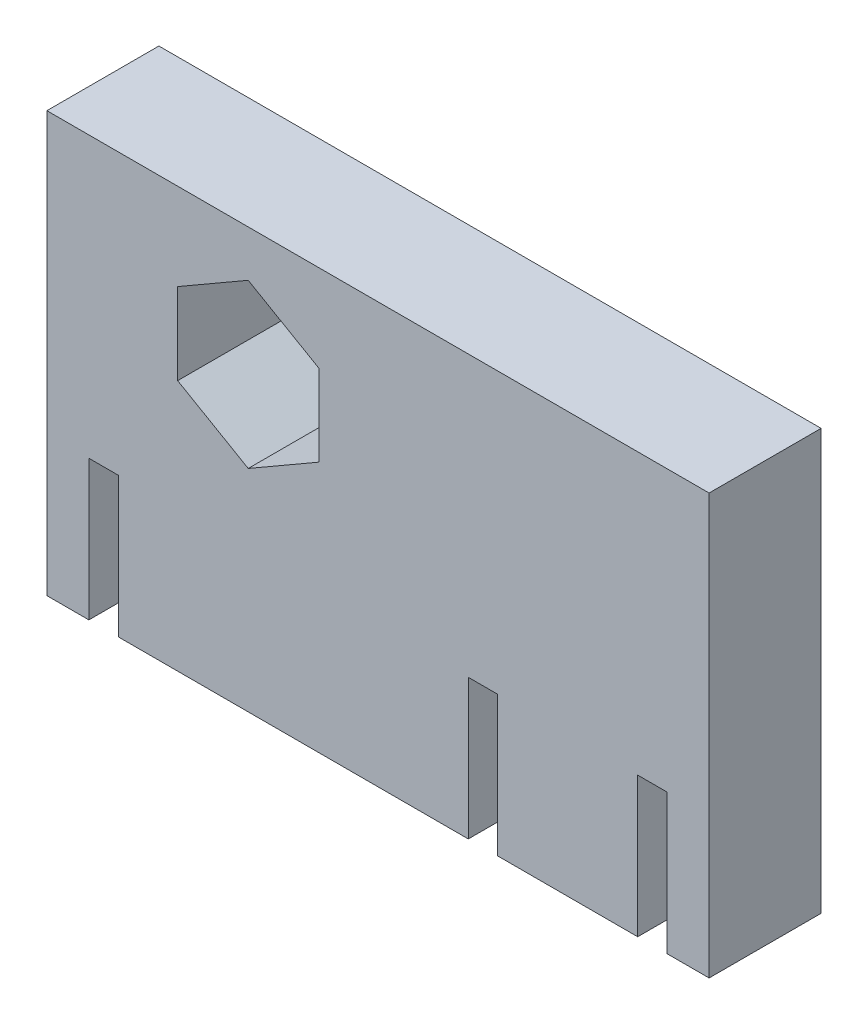
ISO-10303-21;
HEADER;
FILE_DESCRIPTION(('STEP AP214'),'2;1');
FILE_NAME('part.step','',(''),(''),'','','');
FILE_SCHEMA(('AUTOMOTIVE_DESIGN { 1 0 10303 214 1 1 1 1 }'));
ENDSEC;
DATA;
#1=APPLICATION_CONTEXT('core data for automotive mechanical design processes');
#2=APPLICATION_PROTOCOL_DEFINITION('international standard','automotive_design',2000,#1);
#3=PRODUCT_CONTEXT('',#1,'mechanical');
#4=PRODUCT('Part','Part','',(#3));
#5=PRODUCT_RELATED_PRODUCT_CATEGORY('part','',(#4));
#6=PRODUCT_DEFINITION_FORMATION('','',#4);
#7=PRODUCT_DEFINITION_CONTEXT('part definition',#1,'design');
#8=PRODUCT_DEFINITION('design','',#6,#7);
#9=PRODUCT_DEFINITION_SHAPE('','',#8);
#10=(LENGTH_UNIT() NAMED_UNIT(*) SI_UNIT(.MILLI.,.METRE.));
#11=(NAMED_UNIT(*) PLANE_ANGLE_UNIT() SI_UNIT($,.RADIAN.));
#12=(NAMED_UNIT(*) SI_UNIT($,.STERADIAN.) SOLID_ANGLE_UNIT());
#13=UNCERTAINTY_MEASURE_WITH_UNIT(LENGTH_MEASURE(1.E-05),#10,'distance_accuracy_value','');
#14=(GEOMETRIC_REPRESENTATION_CONTEXT(3) GLOBAL_UNCERTAINTY_ASSIGNED_CONTEXT((#13)) GLOBAL_UNIT_ASSIGNED_CONTEXT((#10,
#11,#12)) REPRESENTATION_CONTEXT('',''));
#15=CARTESIAN_POINT('',(0.,0.,0.));
#16=DIRECTION('',(0.,0.,1.));
#17=DIRECTION('',(1.,0.,0.));
#18=AXIS2_PLACEMENT_3D('',#15,#16,#17);
#19=CARTESIAN_POINT('',(0.,0.,8.));
#20=DIRECTION('',(0.,0.,-1.));
#21=DIRECTION('',(-1.,0.,0.));
#22=AXIS2_PLACEMENT_3D('',#19,#20,#21);
#23=PLANE('',#22);
#24=DIRECTION('',(0.,1.,0.));
#25=VECTOR('',#24,1.);
#26=CARTESIAN_POINT('',(23.65,-15.,8.));
#27=LINE('',#26,#25);
#28=CARTESIAN_POINT('',(23.65,-15.,8.));
#29=VERTEX_POINT('',#28);
#30=CARTESIAN_POINT('',(23.65,15.,8.));
#31=VERTEX_POINT('',#30);
#32=EDGE_CURVE('E264',#29,#31,#27,.T.);
#33=ORIENTED_EDGE('',*,*,#32,.T.);
#34=DIRECTION('',(-1.,0.,0.));
#35=VECTOR('',#34,1.);
#36=CARTESIAN_POINT('',(-23.65,15.,8.));
#37=LINE('',#36,#35);
#38=CARTESIAN_POINT('',(-23.65,15.,8.));
#39=VERTEX_POINT('',#38);
#40=EDGE_CURVE('E268',#31,#39,#37,.T.);
#41=ORIENTED_EDGE('',*,*,#40,.T.);
#42=DIRECTION('',(0.,-1.,0.));
#43=VECTOR('',#42,1.);
#44=CARTESIAN_POINT('',(-23.65,-15.,8.));
#45=LINE('',#44,#43);
#46=CARTESIAN_POINT('',(-23.65,-15.,8.));
#47=VERTEX_POINT('',#46);
#48=EDGE_CURVE('E272',#39,#47,#45,.T.);
#49=ORIENTED_EDGE('',*,*,#48,.T.);
#50=DIRECTION('',(1.,0.,0.));
#51=VECTOR('',#50,1.);
#52=CARTESIAN_POINT('',(-23.65,-15.,8.));
#53=LINE('',#52,#51);
#54=CARTESIAN_POINT('',(-20.65,-15.,8.));
#55=VERTEX_POINT('',#54);
#56=EDGE_CURVE('E275',#47,#55,#53,.T.);
#57=ORIENTED_EDGE('',*,*,#56,.T.);
#58=DIRECTION('',(0.,1.,0.));
#59=VECTOR('',#58,1.);
#60=CARTESIAN_POINT('',(-20.65,-15.,8.));
#61=LINE('',#60,#59);
#62=CARTESIAN_POINT('',(-20.65,-5.,8.));
#63=VERTEX_POINT('',#62);
#64=EDGE_CURVE('E278',#55,#63,#61,.T.);
#65=ORIENTED_EDGE('',*,*,#64,.T.);
#66=DIRECTION('',(1.,0.,0.));
#67=VECTOR('',#66,1.);
#68=CARTESIAN_POINT('',(-20.65,-5.,8.));
#69=LINE('',#68,#67);
#70=CARTESIAN_POINT('',(-18.55,-5.,8.));
#71=VERTEX_POINT('',#70);
#72=EDGE_CURVE('E281',#63,#71,#69,.T.);
#73=ORIENTED_EDGE('',*,*,#72,.T.);
#74=DIRECTION('',(0.,-1.,0.));
#75=VECTOR('',#74,1.);
#76=CARTESIAN_POINT('',(-18.55,-5.,8.));
#77=LINE('',#76,#75);
#78=CARTESIAN_POINT('',(-18.55,-15.,8.));
#79=VERTEX_POINT('',#78);
#80=EDGE_CURVE('E284',#71,#79,#77,.T.);
#81=ORIENTED_EDGE('',*,*,#80,.T.);
#82=DIRECTION('',(1.,0.,0.));
#83=VECTOR('',#82,1.);
#84=CARTESIAN_POINT('',(-18.55,-15.,8.));
#85=LINE('',#84,#83);
#86=CARTESIAN_POINT('',(6.45,-15.,8.));
#87=VERTEX_POINT('',#86);
#88=EDGE_CURVE('E287',#79,#87,#85,.T.);
#89=ORIENTED_EDGE('',*,*,#88,.T.);
#90=DIRECTION('',(0.,1.,0.));
#91=VECTOR('',#90,1.);
#92=CARTESIAN_POINT('',(6.45,-15.,8.));
#93=LINE('',#92,#91);
#94=CARTESIAN_POINT('',(6.45,-5.,8.));
#95=VERTEX_POINT('',#94);
#96=EDGE_CURVE('E290',#87,#95,#93,.T.);
#97=ORIENTED_EDGE('',*,*,#96,.T.);
#98=DIRECTION('',(1.,0.,0.));
#99=VECTOR('',#98,1.);
#100=CARTESIAN_POINT('',(6.45,-5.,8.));
#101=LINE('',#100,#99);
#102=CARTESIAN_POINT('',(8.55000000000001,-5.,8.));
#103=VERTEX_POINT('',#102);
#104=EDGE_CURVE('E293',#95,#103,#101,.T.);
#105=ORIENTED_EDGE('',*,*,#104,.T.);
#106=DIRECTION('',(0.,-1.,0.));
#107=VECTOR('',#106,1.);
#108=CARTESIAN_POINT('',(8.55000000000001,-5.,8.));
#109=LINE('',#108,#107);
#110=CARTESIAN_POINT('',(8.55000000000001,-15.,8.));
#111=VERTEX_POINT('',#110);
#112=EDGE_CURVE('E296',#103,#111,#109,.T.);
#113=ORIENTED_EDGE('',*,*,#112,.T.);
#114=DIRECTION('',(1.,0.,0.));
#115=VECTOR('',#114,1.);
#116=CARTESIAN_POINT('',(8.55000000000001,-15.,8.));
#117=LINE('',#116,#115);
#118=CARTESIAN_POINT('',(18.55,-15.,8.));
#119=VERTEX_POINT('',#118);
#120=EDGE_CURVE('E299',#111,#119,#117,.T.);
#121=ORIENTED_EDGE('',*,*,#120,.T.);
#122=DIRECTION('',(0.,1.,0.));
#123=VECTOR('',#122,1.);
#124=CARTESIAN_POINT('',(18.55,-15.,8.));
#125=LINE('',#124,#123);
#126=CARTESIAN_POINT('',(18.55,-5.,8.));
#127=VERTEX_POINT('',#126);
#128=EDGE_CURVE('E302',#119,#127,#125,.T.);
#129=ORIENTED_EDGE('',*,*,#128,.T.);
#130=DIRECTION('',(1.,0.,0.));
#131=VECTOR('',#130,1.);
#132=CARTESIAN_POINT('',(18.55,-5.,8.));
#133=LINE('',#132,#131);
#134=CARTESIAN_POINT('',(20.65,-5.,8.));
#135=VERTEX_POINT('',#134);
#136=EDGE_CURVE('E305',#127,#135,#133,.T.);
#137=ORIENTED_EDGE('',*,*,#136,.T.);
#138=DIRECTION('',(0.,-1.,0.));
#139=VECTOR('',#138,1.);
#140=CARTESIAN_POINT('',(20.65,-5.,8.));
#141=LINE('',#140,#139);
#142=CARTESIAN_POINT('',(20.65,-15.,8.));
#143=VERTEX_POINT('',#142);
#144=EDGE_CURVE('E308',#135,#143,#141,.T.);
#145=ORIENTED_EDGE('',*,*,#144,.T.);
#146=DIRECTION('',(1.,0.,0.));
#147=VECTOR('',#146,1.);
#148=CARTESIAN_POINT('',(20.65,-15.,8.));
#149=LINE('',#148,#147);
#150=EDGE_CURVE('E311',#143,#29,#149,.T.);
#151=ORIENTED_EDGE('',*,*,#150,.T.);
#152=EDGE_LOOP('',(#33,#41,#49,#57,#65,#73,#81,#89,#97,#105,#113,#121,#129,#137,#145,#151));
#153=FACE_BOUND('',#152,.T.);
#154=DIRECTION('',(0.,1.,0.));
#155=VECTOR('',#154,1.);
#156=CARTESIAN_POINT('',(-4.22902577193514,2.96902934007185,8.));
#157=LINE('',#156,#155);
#158=CARTESIAN_POINT('',(-4.22902577193514,2.96902934007185,8.));
#159=VERTEX_POINT('',#158);
#160=CARTESIAN_POINT('',(-4.2290257719351,8.78872005350328,8.));
#161=VERTEX_POINT('',#160);
#162=EDGE_CURVE('E195',#159,#161,#157,.T.);
#163=ORIENTED_EDGE('',*,*,#162,.F.);
#164=DIRECTION('',(0.866025403784442,0.499999999999994,0.));
#165=VECTOR('',#164,1.);
#166=CARTESIAN_POINT('',(-9.26902577193516,0.0591839833561725,8.));
#167=LINE('',#166,#165);
#168=CARTESIAN_POINT('',(-9.26902577193516,0.0591839833561734,8.));
#169=VERTEX_POINT('',#168);
#170=EDGE_CURVE('E230',#169,#159,#167,.T.);
#171=ORIENTED_EDGE('',*,*,#170,.F.);
#172=DIRECTION('',(0.866025403784435,-0.500000000000006,0.));
#173=VECTOR('',#172,1.);
#174=CARTESIAN_POINT('',(-14.3090257719351,2.96902934007192,8.));
#175=LINE('',#174,#173);
#176=CARTESIAN_POINT('',(-14.3090257719351,2.96902934007192,8.));
#177=VERTEX_POINT('',#176);
#178=EDGE_CURVE('E227',#177,#169,#175,.T.);
#179=ORIENTED_EDGE('',*,*,#178,.F.);
#180=DIRECTION('',(0.,-1.,0.));
#181=VECTOR('',#180,1.);
#182=CARTESIAN_POINT('',(-14.3090257719351,8.78872005350335,8.));
#183=LINE('',#182,#181);
#184=CARTESIAN_POINT('',(-14.3090257719351,8.78872005350335,8.));
#185=VERTEX_POINT('',#184);
#186=EDGE_CURVE('E222',#185,#177,#183,.T.);
#187=ORIENTED_EDGE('',*,*,#186,.F.);
#188=DIRECTION('',(-0.866025403784442,-0.499999999999994,0.));
#189=VECTOR('',#188,1.);
#190=CARTESIAN_POINT('',(-9.26902577193508,11.698565410219,8.));
#191=LINE('',#190,#189);
#192=CARTESIAN_POINT('',(-9.26902577193508,11.698565410219,8.));
#193=VERTEX_POINT('',#192);
#194=EDGE_CURVE('E218',#193,#185,#191,.T.);
#195=ORIENTED_EDGE('',*,*,#194,.F.);
#196=DIRECTION('',(-0.866025403784435,0.500000000000006,0.));
#197=VECTOR('',#196,1.);
#198=CARTESIAN_POINT('',(-4.2290257719351,8.78872005350328,8.));
#199=LINE('',#198,#197);
#200=EDGE_CURVE('E204',#161,#193,#199,.T.);
#201=ORIENTED_EDGE('',*,*,#200,.F.);
#202=EDGE_LOOP('',(#163,#171,#179,#187,#195,#201));
#203=FACE_BOUND('',#202,.T.);
#204=ADVANCED_FACE('F45',(#153,#203),#23,.F.);
#205=CARTESIAN_POINT('',(0.,0.,0.));
#206=DIRECTION('',(0.,0.,-1.));
#207=DIRECTION('',(-1.,0.,0.));
#208=AXIS2_PLACEMENT_3D('',#205,#206,#207);
#209=PLANE('',#208);
#210=DIRECTION('',(0.,1.,0.));
#211=VECTOR('',#210,1.);
#212=CARTESIAN_POINT('',(23.65,-15.,0.));
#213=LINE('',#212,#211);
#214=CARTESIAN_POINT('',(23.65,-15.,0.));
#215=VERTEX_POINT('',#214);
#216=CARTESIAN_POINT('',(23.65,15.,0.));
#217=VERTEX_POINT('',#216);
#218=EDGE_CURVE('E213',#215,#217,#213,.T.);
#219=ORIENTED_EDGE('',*,*,#218,.F.);
#220=DIRECTION('',(1.,0.,0.));
#221=VECTOR('',#220,1.);
#222=CARTESIAN_POINT('',(20.65,-15.,0.));
#223=LINE('',#222,#221);
#224=CARTESIAN_POINT('',(20.65,-15.,0.));
#225=VERTEX_POINT('',#224);
#226=EDGE_CURVE('E269',#225,#215,#223,.T.);
#227=ORIENTED_EDGE('',*,*,#226,.F.);
#228=DIRECTION('',(0.,-1.,0.));
#229=VECTOR('',#228,1.);
#230=CARTESIAN_POINT('',(20.65,-5.,0.));
#231=LINE('',#230,#229);
#232=CARTESIAN_POINT('',(20.65,-5.,0.));
#233=VERTEX_POINT('',#232);
#234=EDGE_CURVE('E357',#233,#225,#231,.T.);
#235=ORIENTED_EDGE('',*,*,#234,.F.);
#236=DIRECTION('',(1.,0.,0.));
#237=VECTOR('',#236,1.);
#238=CARTESIAN_POINT('',(18.55,-5.,0.));
#239=LINE('',#238,#237);
#240=CARTESIAN_POINT('',(18.55,-5.,0.));
#241=VERTEX_POINT('',#240);
#242=EDGE_CURVE('E354',#241,#233,#239,.T.);
#243=ORIENTED_EDGE('',*,*,#242,.F.);
#244=DIRECTION('',(0.,1.,0.));
#245=VECTOR('',#244,1.);
#246=CARTESIAN_POINT('',(18.55,-15.,0.));
#247=LINE('',#246,#245);
#248=CARTESIAN_POINT('',(18.55,-15.,0.));
#249=VERTEX_POINT('',#248);
#250=EDGE_CURVE('E351',#249,#241,#247,.T.);
#251=ORIENTED_EDGE('',*,*,#250,.F.);
#252=DIRECTION('',(1.,0.,0.));
#253=VECTOR('',#252,1.);
#254=CARTESIAN_POINT('',(8.55000000000001,-15.,0.));
#255=LINE('',#254,#253);
#256=CARTESIAN_POINT('',(8.55000000000001,-15.,0.));
#257=VERTEX_POINT('',#256);
#258=EDGE_CURVE('E348',#257,#249,#255,.T.);
#259=ORIENTED_EDGE('',*,*,#258,.F.);
#260=DIRECTION('',(0.,-1.,0.));
#261=VECTOR('',#260,1.);
#262=CARTESIAN_POINT('',(8.55000000000001,-5.,0.));
#263=LINE('',#262,#261);
#264=CARTESIAN_POINT('',(8.55000000000001,-5.,0.));
#265=VERTEX_POINT('',#264);
#266=EDGE_CURVE('E345',#265,#257,#263,.T.);
#267=ORIENTED_EDGE('',*,*,#266,.F.);
#268=DIRECTION('',(1.,0.,0.));
#269=VECTOR('',#268,1.);
#270=CARTESIAN_POINT('',(6.45,-5.,0.));
#271=LINE('',#270,#269);
#272=CARTESIAN_POINT('',(6.45,-5.,0.));
#273=VERTEX_POINT('',#272);
#274=EDGE_CURVE('E342',#273,#265,#271,.T.);
#275=ORIENTED_EDGE('',*,*,#274,.F.);
#276=DIRECTION('',(0.,1.,0.));
#277=VECTOR('',#276,1.);
#278=CARTESIAN_POINT('',(6.45,-15.,0.));
#279=LINE('',#278,#277);
#280=CARTESIAN_POINT('',(6.45,-15.,0.));
#281=VERTEX_POINT('',#280);
#282=EDGE_CURVE('E339',#281,#273,#279,.T.);
#283=ORIENTED_EDGE('',*,*,#282,.F.);
#284=DIRECTION('',(1.,0.,0.));
#285=VECTOR('',#284,1.);
#286=CARTESIAN_POINT('',(-18.55,-15.,0.));
#287=LINE('',#286,#285);
#288=CARTESIAN_POINT('',(-18.55,-15.,0.));
#289=VERTEX_POINT('',#288);
#290=EDGE_CURVE('E336',#289,#281,#287,.T.);
#291=ORIENTED_EDGE('',*,*,#290,.F.);
#292=DIRECTION('',(0.,-1.,0.));
#293=VECTOR('',#292,1.);
#294=CARTESIAN_POINT('',(-18.55,-5.,0.));
#295=LINE('',#294,#293);
#296=CARTESIAN_POINT('',(-18.55,-5.,0.));
#297=VERTEX_POINT('',#296);
#298=EDGE_CURVE('E333',#297,#289,#295,.T.);
#299=ORIENTED_EDGE('',*,*,#298,.F.);
#300=DIRECTION('',(1.,0.,0.));
#301=VECTOR('',#300,1.);
#302=CARTESIAN_POINT('',(-20.65,-5.,0.));
#303=LINE('',#302,#301);
#304=CARTESIAN_POINT('',(-20.65,-5.,0.));
#305=VERTEX_POINT('',#304);
#306=EDGE_CURVE('E330',#305,#297,#303,.T.);
#307=ORIENTED_EDGE('',*,*,#306,.F.);
#308=DIRECTION('',(0.,1.,0.));
#309=VECTOR('',#308,1.);
#310=CARTESIAN_POINT('',(-20.65,-15.,0.));
#311=LINE('',#310,#309);
#312=CARTESIAN_POINT('',(-20.65,-15.,0.));
#313=VERTEX_POINT('',#312);
#314=EDGE_CURVE('E327',#313,#305,#311,.T.);
#315=ORIENTED_EDGE('',*,*,#314,.F.);
#316=DIRECTION('',(1.,0.,0.));
#317=VECTOR('',#316,1.);
#318=CARTESIAN_POINT('',(-23.65,-15.,0.));
#319=LINE('',#318,#317);
#320=CARTESIAN_POINT('',(-23.65,-15.,0.));
#321=VERTEX_POINT('',#320);
#322=EDGE_CURVE('E324',#321,#313,#319,.T.);
#323=ORIENTED_EDGE('',*,*,#322,.F.);
#324=DIRECTION('',(0.,-1.,0.));
#325=VECTOR('',#324,1.);
#326=CARTESIAN_POINT('',(-23.65,-15.,0.));
#327=LINE('',#326,#325);
#328=CARTESIAN_POINT('',(-23.65,15.,0.));
#329=VERTEX_POINT('',#328);
#330=EDGE_CURVE('E321',#329,#321,#327,.T.);
#331=ORIENTED_EDGE('',*,*,#330,.F.);
#332=DIRECTION('',(-1.,0.,0.));
#333=VECTOR('',#332,1.);
#334=CARTESIAN_POINT('',(-23.65,15.,0.));
#335=LINE('',#334,#333);
#336=EDGE_CURVE('E318',#217,#329,#335,.T.);
#337=ORIENTED_EDGE('',*,*,#336,.F.);
#338=EDGE_LOOP('',(#219,#227,#235,#243,#251,#259,#267,#275,#283,#291,#299,#307,#315,#323,#331,#337));
#339=FACE_BOUND('',#338,.T.);
#340=DIRECTION('',(0.866025403784442,0.499999999999994,0.));
#341=VECTOR('',#340,1.);
#342=CARTESIAN_POINT('',(-9.26902577193516,0.0591839833561725,0.));
#343=LINE('',#342,#341);
#344=CARTESIAN_POINT('',(-9.26902577193516,0.0591839833561725,0.));
#345=VERTEX_POINT('',#344);
#346=CARTESIAN_POINT('',(-4.22902577193514,2.96902934007185,0.));
#347=VERTEX_POINT('',#346);
#348=EDGE_CURVE('E205',#345,#347,#343,.T.);
#349=ORIENTED_EDGE('',*,*,#348,.T.);
#350=DIRECTION('',(0.,1.,0.));
#351=VECTOR('',#350,1.);
#352=CARTESIAN_POINT('',(-4.22902577193514,2.96902934007185,0.));
#353=LINE('',#352,#351);
#354=CARTESIAN_POINT('',(-4.2290257719351,8.78872005350328,0.));
#355=VERTEX_POINT('',#354);
#356=EDGE_CURVE('E69',#347,#355,#353,.T.);
#357=ORIENTED_EDGE('',*,*,#356,.T.);
#358=DIRECTION('',(-0.866025403784435,0.500000000000006,0.));
#359=VECTOR('',#358,1.);
#360=CARTESIAN_POINT('',(-4.2290257719351,8.78872005350328,0.));
#361=LINE('',#360,#359);
#362=CARTESIAN_POINT('',(-9.26902577193508,11.698565410219,0.));
#363=VERTEX_POINT('',#362);
#364=EDGE_CURVE('E211',#355,#363,#361,.T.);
#365=ORIENTED_EDGE('',*,*,#364,.T.);
#366=DIRECTION('',(-0.866025403784442,-0.499999999999994,0.));
#367=VECTOR('',#366,1.);
#368=CARTESIAN_POINT('',(-9.26902577193508,11.698565410219,0.));
#369=LINE('',#368,#367);
#370=CARTESIAN_POINT('',(-14.3090257719351,8.78872005350335,0.));
#371=VERTEX_POINT('',#370);
#372=EDGE_CURVE('E237',#363,#371,#369,.T.);
#373=ORIENTED_EDGE('',*,*,#372,.T.);
#374=DIRECTION('',(0.,-1.,0.));
#375=VECTOR('',#374,1.);
#376=CARTESIAN_POINT('',(-14.3090257719351,8.78872005350335,0.));
#377=LINE('',#376,#375);
#378=CARTESIAN_POINT('',(-14.3090257719351,2.96902934007192,0.));
#379=VERTEX_POINT('',#378);
#380=EDGE_CURVE('E241',#371,#379,#377,.T.);
#381=ORIENTED_EDGE('',*,*,#380,.T.);
#382=DIRECTION('',(0.866025403784435,-0.500000000000006,0.));
#383=VECTOR('',#382,1.);
#384=CARTESIAN_POINT('',(-14.3090257719351,2.96902934007192,0.));
#385=LINE('',#384,#383);
#386=EDGE_CURVE('E245',#379,#345,#385,.T.);
#387=ORIENTED_EDGE('',*,*,#386,.T.);
#388=EDGE_LOOP('',(#349,#357,#365,#373,#381,#387));
#389=FACE_BOUND('',#388,.T.);
#390=ADVANCED_FACE('F428',(#339,#389),#209,.T.);
#391=CARTESIAN_POINT('',(23.65,-15.,8.));
#392=DIRECTION('',(-1.,0.,0.));
#393=DIRECTION('',(0.,0.,1.));
#394=AXIS2_PLACEMENT_3D('',#391,#392,#393);
#395=PLANE('',#394);
#396=ORIENTED_EDGE('',*,*,#218,.T.);
#397=DIRECTION('',(0.,0.,-1.));
#398=VECTOR('',#397,1.);
#399=CARTESIAN_POINT('',(23.65,15.,8.));
#400=LINE('',#399,#398);
#401=EDGE_CURVE('E11',#31,#217,#400,.T.);
#402=ORIENTED_EDGE('',*,*,#401,.F.);
#403=ORIENTED_EDGE('',*,*,#32,.F.);
#404=DIRECTION('',(0.,0.,-1.));
#405=VECTOR('',#404,1.);
#406=CARTESIAN_POINT('',(23.65,-15.,8.));
#407=LINE('',#406,#405);
#408=EDGE_CURVE('E314',#29,#215,#407,.T.);
#409=ORIENTED_EDGE('',*,*,#408,.T.);
#410=EDGE_LOOP('',(#396,#402,#403,#409));
#411=FACE_BOUND('',#410,.T.);
#412=ADVANCED_FACE('F47',(#411),#395,.F.);
#413=CARTESIAN_POINT('',(-23.65,15.,8.));
#414=DIRECTION('',(0.,-1.,0.));
#415=DIRECTION('',(0.,0.,-1.));
#416=AXIS2_PLACEMENT_3D('',#413,#414,#415);
#417=PLANE('',#416);
#418=ORIENTED_EDGE('',*,*,#336,.T.);
#419=DIRECTION('',(0.,0.,-1.));
#420=VECTOR('',#419,1.);
#421=CARTESIAN_POINT('',(-23.65,15.,8.));
#422=LINE('',#421,#420);
#423=EDGE_CURVE('E54',#39,#329,#422,.T.);
#424=ORIENTED_EDGE('',*,*,#423,.F.);
#425=ORIENTED_EDGE('',*,*,#40,.F.);
#426=ORIENTED_EDGE('',*,*,#401,.T.);
#427=EDGE_LOOP('',(#418,#424,#425,#426));
#428=FACE_BOUND('',#427,.T.);
#429=ADVANCED_FACE('F445',(#428),#417,.F.);
#430=CARTESIAN_POINT('',(-23.65,-15.,8.));
#431=DIRECTION('',(1.,0.,0.));
#432=DIRECTION('',(0.,0.,-1.));
#433=AXIS2_PLACEMENT_3D('',#430,#431,#432);
#434=PLANE('',#433);
#435=ORIENTED_EDGE('',*,*,#330,.T.);
#436=DIRECTION('',(0.,0.,-1.));
#437=VECTOR('',#436,1.);
#438=CARTESIAN_POINT('',(-23.65,-15.,8.));
#439=LINE('',#438,#437);
#440=EDGE_CURVE('E413',#47,#321,#439,.T.);
#441=ORIENTED_EDGE('',*,*,#440,.F.);
#442=ORIENTED_EDGE('',*,*,#48,.F.);
#443=ORIENTED_EDGE('',*,*,#423,.T.);
#444=EDGE_LOOP('',(#435,#441,#442,#443));
#445=FACE_BOUND('',#444,.T.);
#446=ADVANCED_FACE('F422',(#445),#434,.F.);
#447=CARTESIAN_POINT('',(-23.65,-15.,8.));
#448=DIRECTION('',(0.,1.,0.));
#449=DIRECTION('',(0.,0.,1.));
#450=AXIS2_PLACEMENT_3D('',#447,#448,#449);
#451=PLANE('',#450);
#452=ORIENTED_EDGE('',*,*,#322,.T.);
#453=DIRECTION('',(0.,0.,-1.));
#454=VECTOR('',#453,1.);
#455=CARTESIAN_POINT('',(-20.65,-15.,8.));
#456=LINE('',#455,#454);
#457=EDGE_CURVE('E409',#55,#313,#456,.T.);
#458=ORIENTED_EDGE('',*,*,#457,.F.);
#459=ORIENTED_EDGE('',*,*,#56,.F.);
#460=ORIENTED_EDGE('',*,*,#440,.T.);
#461=EDGE_LOOP('',(#452,#458,#459,#460));
#462=FACE_BOUND('',#461,.T.);
#463=ADVANCED_FACE('F434',(#462),#451,.F.);
#464=CARTESIAN_POINT('',(-20.65,-15.,8.));
#465=DIRECTION('',(-1.,0.,0.));
#466=DIRECTION('',(0.,-1.,0.));
#467=AXIS2_PLACEMENT_3D('',#464,#465,#466);
#468=PLANE('',#467);
#469=ORIENTED_EDGE('',*,*,#314,.T.);
#470=DIRECTION('',(0.,0.,-1.));
#471=VECTOR('',#470,1.);
#472=CARTESIAN_POINT('',(-20.65,-5.,8.));
#473=LINE('',#472,#471);
#474=EDGE_CURVE('E405',#63,#305,#473,.T.);
#475=ORIENTED_EDGE('',*,*,#474,.F.);
#476=ORIENTED_EDGE('',*,*,#64,.F.);
#477=ORIENTED_EDGE('',*,*,#457,.T.);
#478=EDGE_LOOP('',(#469,#475,#476,#477));
#479=FACE_BOUND('',#478,.T.);
#480=ADVANCED_FACE('F438',(#479),#468,.F.);
#481=CARTESIAN_POINT('',(-20.65,-5.,8.));
#482=DIRECTION('',(0.,1.,0.));
#483=DIRECTION('',(0.,0.,1.));
#484=AXIS2_PLACEMENT_3D('',#481,#482,#483);
#485=PLANE('',#484);
#486=ORIENTED_EDGE('',*,*,#306,.T.);
#487=DIRECTION('',(0.,0.,-1.));
#488=VECTOR('',#487,1.);
#489=CARTESIAN_POINT('',(-18.55,-5.,8.));
#490=LINE('',#489,#488);
#491=EDGE_CURVE('E401',#71,#297,#490,.T.);
#492=ORIENTED_EDGE('',*,*,#491,.F.);
#493=ORIENTED_EDGE('',*,*,#72,.F.);
#494=ORIENTED_EDGE('',*,*,#474,.T.);
#495=EDGE_LOOP('',(#486,#492,#493,#494));
#496=FACE_BOUND('',#495,.T.);
#497=ADVANCED_FACE('F498',(#496),#485,.F.);
#498=CARTESIAN_POINT('',(-18.55,-5.,8.));
#499=DIRECTION('',(1.,0.,0.));
#500=DIRECTION('',(0.,0.,-1.));
#501=AXIS2_PLACEMENT_3D('',#498,#499,#500);
#502=PLANE('',#501);
#503=ORIENTED_EDGE('',*,*,#298,.T.);
#504=DIRECTION('',(0.,0.,-1.));
#505=VECTOR('',#504,1.);
#506=CARTESIAN_POINT('',(-18.55,-15.,8.));
#507=LINE('',#506,#505);
#508=EDGE_CURVE('E397',#79,#289,#507,.T.);
#509=ORIENTED_EDGE('',*,*,#508,.F.);
#510=ORIENTED_EDGE('',*,*,#80,.F.);
#511=ORIENTED_EDGE('',*,*,#491,.T.);
#512=EDGE_LOOP('',(#503,#509,#510,#511));
#513=FACE_BOUND('',#512,.T.);
#514=ADVANCED_FACE('F495',(#513),#502,.F.);
#515=CARTESIAN_POINT('',(-18.55,-15.,8.));
#516=DIRECTION('',(0.,1.,0.));
#517=DIRECTION('',(-1.,0.,0.));
#518=AXIS2_PLACEMENT_3D('',#515,#516,#517);
#519=PLANE('',#518);
#520=ORIENTED_EDGE('',*,*,#290,.T.);
#521=DIRECTION('',(0.,0.,-1.));
#522=VECTOR('',#521,1.);
#523=CARTESIAN_POINT('',(6.45,-15.,8.));
#524=LINE('',#523,#522);
#525=EDGE_CURVE('E393',#87,#281,#524,.T.);
#526=ORIENTED_EDGE('',*,*,#525,.F.);
#527=ORIENTED_EDGE('',*,*,#88,.F.);
#528=ORIENTED_EDGE('',*,*,#508,.T.);
#529=EDGE_LOOP('',(#520,#526,#527,#528));
#530=FACE_BOUND('',#529,.T.);
#531=ADVANCED_FACE('F491',(#530),#519,.F.);
#532=CARTESIAN_POINT('',(6.45,-15.,8.));
#533=DIRECTION('',(-1.,0.,0.));
#534=DIRECTION('',(0.,0.,1.));
#535=AXIS2_PLACEMENT_3D('',#532,#533,#534);
#536=PLANE('',#535);
#537=ORIENTED_EDGE('',*,*,#282,.T.);
#538=DIRECTION('',(0.,0.,-1.));
#539=VECTOR('',#538,1.);
#540=CARTESIAN_POINT('',(6.45,-5.,8.));
#541=LINE('',#540,#539);
#542=EDGE_CURVE('E389',#95,#273,#541,.T.);
#543=ORIENTED_EDGE('',*,*,#542,.F.);
#544=ORIENTED_EDGE('',*,*,#96,.F.);
#545=ORIENTED_EDGE('',*,*,#525,.T.);
#546=EDGE_LOOP('',(#537,#543,#544,#545));
#547=FACE_BOUND('',#546,.T.);
#548=ADVANCED_FACE('F487',(#547),#536,.F.);
#549=CARTESIAN_POINT('',(6.45,-5.,8.));
#550=DIRECTION('',(0.,1.,0.));
#551=DIRECTION('',(0.,0.,1.));
#552=AXIS2_PLACEMENT_3D('',#549,#550,#551);
#553=PLANE('',#552);
#554=ORIENTED_EDGE('',*,*,#274,.T.);
#555=DIRECTION('',(0.,0.,-1.));
#556=VECTOR('',#555,1.);
#557=CARTESIAN_POINT('',(8.55000000000001,-5.,8.));
#558=LINE('',#557,#556);
#559=EDGE_CURVE('E385',#103,#265,#558,.T.);
#560=ORIENTED_EDGE('',*,*,#559,.F.);
#561=ORIENTED_EDGE('',*,*,#104,.F.);
#562=ORIENTED_EDGE('',*,*,#542,.T.);
#563=EDGE_LOOP('',(#554,#560,#561,#562));
#564=FACE_BOUND('',#563,.T.);
#565=ADVANCED_FACE('F482',(#564),#553,.F.);
#566=CARTESIAN_POINT('',(8.55000000000001,-5.,8.));
#567=DIRECTION('',(1.,0.,0.));
#568=DIRECTION('',(0.,1.,0.));
#569=AXIS2_PLACEMENT_3D('',#566,#567,#568);
#570=PLANE('',#569);
#571=ORIENTED_EDGE('',*,*,#266,.T.);
#572=DIRECTION('',(0.,0.,-1.));
#573=VECTOR('',#572,1.);
#574=CARTESIAN_POINT('',(8.55000000000001,-15.,8.));
#575=LINE('',#574,#573);
#576=EDGE_CURVE('E381',#111,#257,#575,.T.);
#577=ORIENTED_EDGE('',*,*,#576,.F.);
#578=ORIENTED_EDGE('',*,*,#112,.F.);
#579=ORIENTED_EDGE('',*,*,#559,.T.);
#580=EDGE_LOOP('',(#571,#577,#578,#579));
#581=FACE_BOUND('',#580,.T.);
#582=ADVANCED_FACE('F476',(#581),#570,.F.);
#583=CARTESIAN_POINT('',(8.55000000000001,-15.,8.));
#584=DIRECTION('',(0.,1.,0.));
#585=DIRECTION('',(0.,0.,1.));
#586=AXIS2_PLACEMENT_3D('',#583,#584,#585);
#587=PLANE('',#586);
#588=ORIENTED_EDGE('',*,*,#258,.T.);
#589=DIRECTION('',(0.,0.,-1.));
#590=VECTOR('',#589,1.);
#591=CARTESIAN_POINT('',(18.55,-15.,8.));
#592=LINE('',#591,#590);
#593=EDGE_CURVE('E377',#119,#249,#592,.T.);
#594=ORIENTED_EDGE('',*,*,#593,.F.);
#595=ORIENTED_EDGE('',*,*,#120,.F.);
#596=ORIENTED_EDGE('',*,*,#576,.T.);
#597=EDGE_LOOP('',(#588,#594,#595,#596));
#598=FACE_BOUND('',#597,.T.);
#599=ADVANCED_FACE('F472',(#598),#587,.F.);
#600=CARTESIAN_POINT('',(18.55,-15.,8.));
#601=DIRECTION('',(-1.,0.,0.));
#602=DIRECTION('',(0.,-1.,0.));
#603=AXIS2_PLACEMENT_3D('',#600,#601,#602);
#604=PLANE('',#603);
#605=ORIENTED_EDGE('',*,*,#250,.T.);
#606=DIRECTION('',(0.,0.,-1.));
#607=VECTOR('',#606,1.);
#608=CARTESIAN_POINT('',(18.55,-5.,8.));
#609=LINE('',#608,#607);
#610=EDGE_CURVE('E373',#127,#241,#609,.T.);
#611=ORIENTED_EDGE('',*,*,#610,.F.);
#612=ORIENTED_EDGE('',*,*,#128,.F.);
#613=ORIENTED_EDGE('',*,*,#593,.T.);
#614=EDGE_LOOP('',(#605,#611,#612,#613));
#615=FACE_BOUND('',#614,.T.);
#616=ADVANCED_FACE('F467',(#615),#604,.F.);
#617=CARTESIAN_POINT('',(18.55,-5.,8.));
#618=DIRECTION('',(0.,1.,0.));
#619=DIRECTION('',(0.,0.,1.));
#620=AXIS2_PLACEMENT_3D('',#617,#618,#619);
#621=PLANE('',#620);
#622=ORIENTED_EDGE('',*,*,#242,.T.);
#623=DIRECTION('',(0.,0.,-1.));
#624=VECTOR('',#623,1.);
#625=CARTESIAN_POINT('',(20.65,-5.,8.));
#626=LINE('',#625,#624);
#627=EDGE_CURVE('E369',#135,#233,#626,.T.);
#628=ORIENTED_EDGE('',*,*,#627,.F.);
#629=ORIENTED_EDGE('',*,*,#136,.F.);
#630=ORIENTED_EDGE('',*,*,#610,.T.);
#631=EDGE_LOOP('',(#622,#628,#629,#630));
#632=FACE_BOUND('',#631,.T.);
#633=ADVANCED_FACE('F461',(#632),#621,.F.);
#634=CARTESIAN_POINT('',(20.65,-5.,8.));
#635=DIRECTION('',(1.,0.,0.));
#636=DIRECTION('',(0.,0.,-1.));
#637=AXIS2_PLACEMENT_3D('',#634,#635,#636);
#638=PLANE('',#637);
#639=ORIENTED_EDGE('',*,*,#234,.T.);
#640=DIRECTION('',(0.,0.,-1.));
#641=VECTOR('',#640,1.);
#642=CARTESIAN_POINT('',(20.65,-15.,8.));
#643=LINE('',#642,#641);
#644=EDGE_CURVE('E365',#143,#225,#643,.T.);
#645=ORIENTED_EDGE('',*,*,#644,.F.);
#646=ORIENTED_EDGE('',*,*,#144,.F.);
#647=ORIENTED_EDGE('',*,*,#627,.T.);
#648=EDGE_LOOP('',(#639,#645,#646,#647));
#649=FACE_BOUND('',#648,.T.);
#650=ADVANCED_FACE('F457',(#649),#638,.F.);
#651=CARTESIAN_POINT('',(20.65,-15.,8.));
#652=DIRECTION('',(0.,1.,0.));
#653=DIRECTION('',(-1.,0.,0.));
#654=AXIS2_PLACEMENT_3D('',#651,#652,#653);
#655=PLANE('',#654);
#656=ORIENTED_EDGE('',*,*,#226,.T.);
#657=ORIENTED_EDGE('',*,*,#408,.F.);
#658=ORIENTED_EDGE('',*,*,#150,.F.);
#659=ORIENTED_EDGE('',*,*,#644,.T.);
#660=EDGE_LOOP('',(#656,#657,#658,#659));
#661=FACE_BOUND('',#660,.T.);
#662=ADVANCED_FACE('F452',(#661),#655,.F.);
#663=CARTESIAN_POINT('',(-4.22902577193514,2.96902934007185,8.));
#664=DIRECTION('',(-1.,0.,0.));
#665=DIRECTION('',(0.,-1.,0.));
#666=AXIS2_PLACEMENT_3D('',#663,#664,#665);
#667=PLANE('',#666);
#668=ORIENTED_EDGE('',*,*,#356,.F.);
#669=DIRECTION('',(0.,0.,-1.));
#670=VECTOR('',#669,1.);
#671=CARTESIAN_POINT('',(-4.22902577193514,2.96902934007185,8.));
#672=LINE('',#671,#670);
#673=EDGE_CURVE('E199',#159,#347,#672,.T.);
#674=ORIENTED_EDGE('',*,*,#673,.F.);
#675=ORIENTED_EDGE('',*,*,#162,.T.);
#676=DIRECTION('',(0.,0.,-1.));
#677=VECTOR('',#676,1.);
#678=CARTESIAN_POINT('',(-4.2290257719351,8.78872005350328,8.));
#679=LINE('',#678,#677);
#680=EDGE_CURVE('E198',#161,#355,#679,.T.);
#681=ORIENTED_EDGE('',*,*,#680,.T.);
#682=EDGE_LOOP('',(#668,#674,#675,#681));
#683=FACE_BOUND('',#682,.T.);
#684=ADVANCED_FACE('F197',(#683),#667,.T.);
#685=CARTESIAN_POINT('',(-4.2290257719351,8.78872005350328,8.));
#686=DIRECTION('',(-0.500000000000006,-0.866025403784435,0.));
#687=DIRECTION('',(0.866025403784435,-0.500000000000006,0.));
#688=AXIS2_PLACEMENT_3D('',#685,#686,#687);
#689=PLANE('',#688);
#690=ORIENTED_EDGE('',*,*,#364,.F.);
#691=ORIENTED_EDGE('',*,*,#680,.F.);
#692=ORIENTED_EDGE('',*,*,#200,.T.);
#693=DIRECTION('',(0.,0.,-1.));
#694=VECTOR('',#693,1.);
#695=CARTESIAN_POINT('',(-9.26902577193508,11.698565410219,8.));
#696=LINE('',#695,#694);
#697=EDGE_CURVE('E214',#193,#363,#696,.T.);
#698=ORIENTED_EDGE('',*,*,#697,.T.);
#699=EDGE_LOOP('',(#690,#691,#692,#698));
#700=FACE_BOUND('',#699,.T.);
#701=ADVANCED_FACE('F208',(#700),#689,.T.);
#702=CARTESIAN_POINT('',(-9.26902577193508,11.698565410219,8.));
#703=DIRECTION('',(0.499999999999994,-0.866025403784442,0.));
#704=DIRECTION('',(0.866025403784442,0.499999999999994,0.));
#705=AXIS2_PLACEMENT_3D('',#702,#703,#704);
#706=PLANE('',#705);
#707=ORIENTED_EDGE('',*,*,#372,.F.);
#708=ORIENTED_EDGE('',*,*,#697,.F.);
#709=ORIENTED_EDGE('',*,*,#194,.T.);
#710=DIRECTION('',(0.,0.,-1.));
#711=VECTOR('',#710,1.);
#712=CARTESIAN_POINT('',(-14.3090257719351,8.78872005350335,8.));
#713=LINE('',#712,#711);
#714=EDGE_CURVE('E259',#185,#371,#713,.T.);
#715=ORIENTED_EDGE('',*,*,#714,.T.);
#716=EDGE_LOOP('',(#707,#708,#709,#715));
#717=FACE_BOUND('',#716,.T.);
#718=ADVANCED_FACE('F590',(#717),#706,.T.);
#719=CARTESIAN_POINT('',(-14.3090257719351,8.78872005350335,8.));
#720=DIRECTION('',(1.,0.,0.));
#721=DIRECTION('',(0.,1.,0.));
#722=AXIS2_PLACEMENT_3D('',#719,#720,#721);
#723=PLANE('',#722);
#724=ORIENTED_EDGE('',*,*,#380,.F.);
#725=ORIENTED_EDGE('',*,*,#714,.F.);
#726=ORIENTED_EDGE('',*,*,#186,.T.);
#727=DIRECTION('',(0.,0.,-1.));
#728=VECTOR('',#727,1.);
#729=CARTESIAN_POINT('',(-14.3090257719351,2.96902934007192,8.));
#730=LINE('',#729,#728);
#731=EDGE_CURVE('E256',#177,#379,#730,.T.);
#732=ORIENTED_EDGE('',*,*,#731,.T.);
#733=EDGE_LOOP('',(#724,#725,#726,#732));
#734=FACE_BOUND('',#733,.T.);
#735=ADVANCED_FACE('F597',(#734),#723,.T.);
#736=CARTESIAN_POINT('',(-14.3090257719351,2.96902934007192,8.));
#737=DIRECTION('',(0.500000000000006,0.866025403784435,0.));
#738=DIRECTION('',(-0.866025403784435,0.500000000000006,0.));
#739=AXIS2_PLACEMENT_3D('',#736,#737,#738);
#740=PLANE('',#739);
#741=ORIENTED_EDGE('',*,*,#386,.F.);
#742=ORIENTED_EDGE('',*,*,#731,.F.);
#743=ORIENTED_EDGE('',*,*,#178,.T.);
#744=DIRECTION('',(0.,0.,-1.));
#745=VECTOR('',#744,1.);
#746=CARTESIAN_POINT('',(-9.26902577193516,0.0591839833561725,8.));
#747=LINE('',#746,#745);
#748=EDGE_CURVE('E61',#169,#345,#747,.T.);
#749=ORIENTED_EDGE('',*,*,#748,.T.);
#750=EDGE_LOOP('',(#741,#742,#743,#749));
#751=FACE_BOUND('',#750,.T.);
#752=ADVANCED_FACE('F606',(#751),#740,.T.);
#753=CARTESIAN_POINT('',(-9.26902577193516,0.0591839833561725,8.));
#754=DIRECTION('',(-0.499999999999994,0.866025403784442,0.));
#755=DIRECTION('',(-0.866025403784442,-0.499999999999994,0.));
#756=AXIS2_PLACEMENT_3D('',#753,#754,#755);
#757=PLANE('',#756);
#758=ORIENTED_EDGE('',*,*,#348,.F.);
#759=ORIENTED_EDGE('',*,*,#748,.F.);
#760=ORIENTED_EDGE('',*,*,#170,.T.);
#761=ORIENTED_EDGE('',*,*,#673,.T.);
#762=EDGE_LOOP('',(#758,#759,#760,#761));
#763=FACE_BOUND('',#762,.T.);
#764=ADVANCED_FACE('F615',(#763),#757,.T.);
#765=CLOSED_SHELL('',(#204,#390,#412,#429,#446,#463,#480,#497,#514,#531,#548,#565,#582,#599,
#616,#633,#650,#662,#684,#701,#718,#735,#752,#764));
#766=MANIFOLD_SOLID_BREP('B2',#765);
#767=ADVANCED_BREP_SHAPE_REPRESENTATION('',(#18,#766),#14);
#768=SHAPE_DEFINITION_REPRESENTATION(#9,#767);
ENDSEC;
END-ISO-10303-21;
